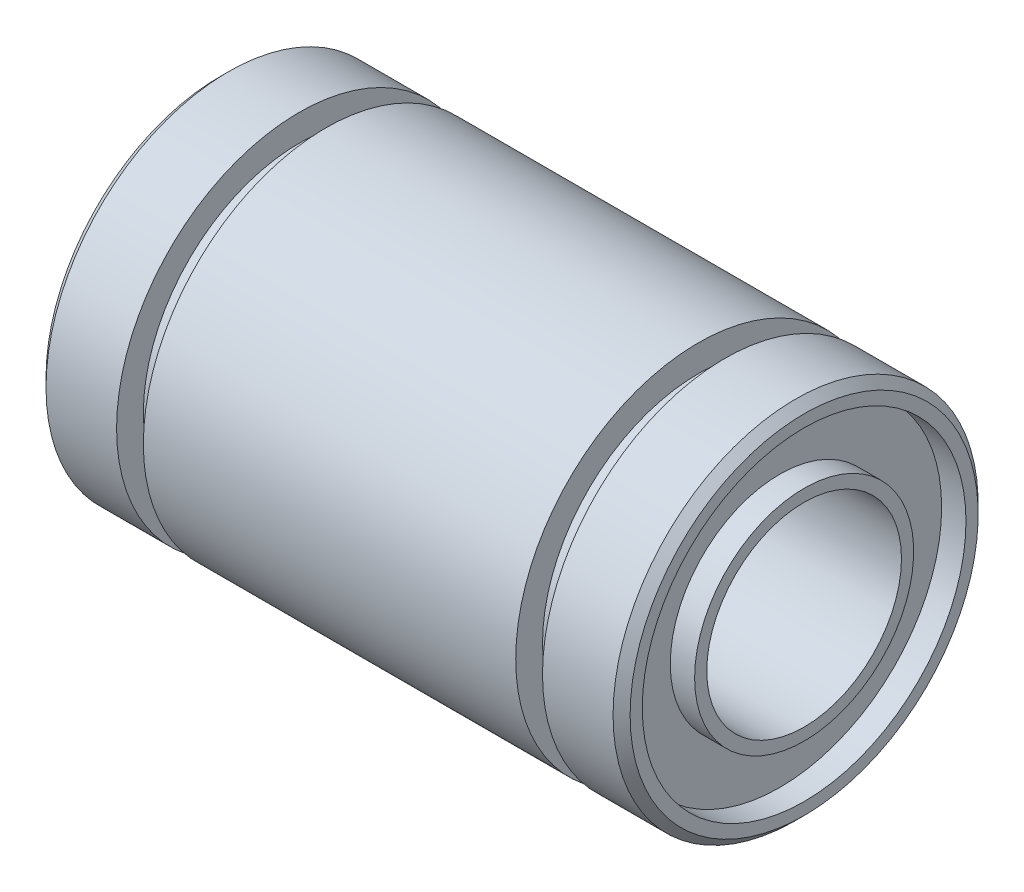
ISO-10303-21;
HEADER;
FILE_DESCRIPTION(('STEP AP214'),'2;1');
FILE_NAME('part.step','',(''),(''),'','','');
FILE_SCHEMA(('AUTOMOTIVE_DESIGN { 1 0 10303 214 1 1 1 1 }'));
ENDSEC;
DATA;
#1=APPLICATION_CONTEXT('core data for automotive mechanical design processes');
#2=APPLICATION_PROTOCOL_DEFINITION('international standard','automotive_design',2000,#1);
#3=PRODUCT_CONTEXT('',#1,'mechanical');
#4=PRODUCT('Part','Part','',(#3));
#5=PRODUCT_RELATED_PRODUCT_CATEGORY('part','',(#4));
#6=PRODUCT_DEFINITION_FORMATION('','',#4);
#7=PRODUCT_DEFINITION_CONTEXT('part definition',#1,'design');
#8=PRODUCT_DEFINITION('design','',#6,#7);
#9=PRODUCT_DEFINITION_SHAPE('','',#8);
#10=(LENGTH_UNIT() NAMED_UNIT(*) SI_UNIT(.MILLI.,.METRE.));
#11=(NAMED_UNIT(*) PLANE_ANGLE_UNIT() SI_UNIT($,.RADIAN.));
#12=(NAMED_UNIT(*) SI_UNIT($,.STERADIAN.) SOLID_ANGLE_UNIT());
#13=UNCERTAINTY_MEASURE_WITH_UNIT(LENGTH_MEASURE(1.E-05),#10,'distance_accuracy_value','');
#14=(GEOMETRIC_REPRESENTATION_CONTEXT(3) GLOBAL_UNCERTAINTY_ASSIGNED_CONTEXT((#13)) GLOBAL_UNIT_ASSIGNED_CONTEXT((#10,
#11,#12)) REPRESENTATION_CONTEXT('',''));
#15=CARTESIAN_POINT('',(0.,0.,0.));
#16=DIRECTION('',(0.,0.,1.));
#17=DIRECTION('',(1.,0.,0.));
#18=AXIS2_PLACEMENT_3D('',#15,#16,#17);
#19=CARTESIAN_POINT('',(11.65,0.,0.));
#20=DIRECTION('',(-1.,0.,0.));
#21=DIRECTION('',(0.,0.,1.));
#22=AXIS2_PLACEMENT_3D('',#19,#20,#21);
#23=CONICAL_SURFACE('',#22,7.5,0.78539816339745);
#24=CARTESIAN_POINT('',(12.,0.,0.));
#25=DIRECTION('',(-1.,0.,0.));
#26=DIRECTION('',(0.,0.,1.));
#27=AXIS2_PLACEMENT_3D('',#24,#25,#26);
#28=CIRCLE('',#27,7.15);
#29=CARTESIAN_POINT('',(12.,0.,7.15));
#30=VERTEX_POINT('',#29);
#31=EDGE_CURVE('E109',#30,#30,#28,.T.);
#32=ORIENTED_EDGE('',*,*,#31,.T.);
#33=EDGE_LOOP('',(#32));
#34=FACE_BOUND('',#33,.T.);
#35=CARTESIAN_POINT('',(11.65,0.,0.));
#36=DIRECTION('',(-1.,0.,0.));
#37=DIRECTION('',(0.,0.,1.));
#38=AXIS2_PLACEMENT_3D('',#35,#36,#37);
#39=CIRCLE('',#38,7.5);
#40=CARTESIAN_POINT('',(11.65,0.,7.5));
#41=VERTEX_POINT('',#40);
#42=EDGE_CURVE('E10',#41,#41,#39,.T.);
#43=ORIENTED_EDGE('',*,*,#42,.F.);
#44=EDGE_LOOP('',(#43));
#45=FACE_BOUND('',#44,.T.);
#46=ADVANCED_FACE('F39',(#34,#45),#23,.T.);
#47=CARTESIAN_POINT('',(-45.6895053247726,0.,0.));
#48=DIRECTION('',(-1.,0.,0.));
#49=DIRECTION('',(0.,0.,1.));
#50=AXIS2_PLACEMENT_3D('',#47,#48,#49);
#51=CYLINDRICAL_SURFACE('',#50,7.5);
#52=CARTESIAN_POINT('',(8.75000000000001,0.,0.));
#53=DIRECTION('',(-1.,0.,0.));
#54=DIRECTION('',(0.,0.,1.));
#55=AXIS2_PLACEMENT_3D('',#52,#53,#54);
#56=CIRCLE('',#55,7.5);
#57=CARTESIAN_POINT('',(8.75000000000001,0.,7.5));
#58=VERTEX_POINT('',#57);
#59=EDGE_CURVE('E45',#58,#58,#56,.T.);
#60=ORIENTED_EDGE('',*,*,#59,.F.);
#61=EDGE_LOOP('',(#60));
#62=FACE_BOUND('',#61,.T.);
#63=ORIENTED_EDGE('',*,*,#42,.T.);
#64=EDGE_LOOP('',(#63));
#65=FACE_BOUND('',#64,.T.);
#66=ADVANCED_FACE('F127',(#62,#65),#51,.T.);
#67=CARTESIAN_POINT('',(8.75000000000001,0.,0.));
#68=DIRECTION('',(1.,0.,0.));
#69=DIRECTION('',(0.,0.,-1.));
#70=AXIS2_PLACEMENT_3D('',#67,#68,#69);
#71=PLANE('',#70);
#72=CARTESIAN_POINT('',(8.75000000000001,0.,0.));
#73=DIRECTION('',(-1.,0.,0.));
#74=DIRECTION('',(0.,0.,1.));
#75=AXIS2_PLACEMENT_3D('',#72,#73,#74);
#76=CIRCLE('',#75,6.4);
#77=CARTESIAN_POINT('',(8.75000000000001,0.,6.4));
#78=VERTEX_POINT('',#77);
#79=EDGE_CURVE('E49',#78,#78,#76,.T.);
#80=ORIENTED_EDGE('',*,*,#79,.F.);
#81=EDGE_LOOP('',(#80));
#82=FACE_BOUND('',#81,.T.);
#83=ORIENTED_EDGE('',*,*,#59,.T.);
#84=EDGE_LOOP('',(#83));
#85=FACE_BOUND('',#84,.T.);
#86=ADVANCED_FACE('F131',(#82,#85),#71,.F.);
#87=CARTESIAN_POINT('',(-45.6895053247726,0.,0.));
#88=DIRECTION('',(-1.,0.,0.));
#89=DIRECTION('',(0.,0.,1.));
#90=AXIS2_PLACEMENT_3D('',#87,#88,#89);
#91=CYLINDRICAL_SURFACE('',#90,6.4);
#92=CARTESIAN_POINT('',(7.65,0.,0.));
#93=DIRECTION('',(-1.,0.,0.));
#94=DIRECTION('',(0.,0.,1.));
#95=AXIS2_PLACEMENT_3D('',#92,#93,#94);
#96=CIRCLE('',#95,6.4);
#97=CARTESIAN_POINT('',(7.65,0.,6.4));
#98=VERTEX_POINT('',#97);
#99=EDGE_CURVE('E53',#98,#98,#96,.T.);
#100=ORIENTED_EDGE('',*,*,#99,.F.);
#101=EDGE_LOOP('',(#100));
#102=FACE_BOUND('',#101,.T.);
#103=ORIENTED_EDGE('',*,*,#79,.T.);
#104=EDGE_LOOP('',(#103));
#105=FACE_BOUND('',#104,.T.);
#106=ADVANCED_FACE('F136',(#102,#105),#91,.T.);
#107=CARTESIAN_POINT('',(7.65,0.,0.));
#108=DIRECTION('',(-1.,0.,0.));
#109=DIRECTION('',(0.,0.,1.));
#110=AXIS2_PLACEMENT_3D('',#107,#108,#109);
#111=PLANE('',#110);
#112=CARTESIAN_POINT('',(7.65,0.,0.));
#113=DIRECTION('',(-1.,0.,0.));
#114=DIRECTION('',(0.,0.,1.));
#115=AXIS2_PLACEMENT_3D('',#112,#113,#114);
#116=CIRCLE('',#115,7.5);
#117=CARTESIAN_POINT('',(7.65,0.,7.5));
#118=VERTEX_POINT('',#117);
#119=EDGE_CURVE('E58',#118,#118,#116,.T.);
#120=ORIENTED_EDGE('',*,*,#119,.F.);
#121=EDGE_LOOP('',(#120));
#122=FACE_BOUND('',#121,.T.);
#123=ORIENTED_EDGE('',*,*,#99,.T.);
#124=EDGE_LOOP('',(#123));
#125=FACE_BOUND('',#124,.T.);
#126=ADVANCED_FACE('F142',(#122,#125),#111,.F.);
#127=CARTESIAN_POINT('',(-45.6895053247726,0.,0.));
#128=DIRECTION('',(-1.,0.,0.));
#129=DIRECTION('',(0.,0.,1.));
#130=AXIS2_PLACEMENT_3D('',#127,#128,#129);
#131=CYLINDRICAL_SURFACE('',#130,7.5);
#132=ORIENTED_EDGE('',*,*,#119,.T.);
#133=EDGE_LOOP('',(#132));
#134=FACE_BOUND('',#133,.T.);
#135=CARTESIAN_POINT('',(-7.65,0.,0.));
#136=DIRECTION('',(-1.,0.,0.));
#137=DIRECTION('',(0.,0.,1.));
#138=AXIS2_PLACEMENT_3D('',#135,#136,#137);
#139=CIRCLE('',#138,7.5);
#140=CARTESIAN_POINT('',(-7.65,0.,7.5));
#141=VERTEX_POINT('',#140);
#142=EDGE_CURVE('E61',#141,#141,#139,.T.);
#143=ORIENTED_EDGE('',*,*,#142,.F.);
#144=EDGE_LOOP('',(#143));
#145=FACE_BOUND('',#144,.T.);
#146=ADVANCED_FACE('F146',(#134,#145),#131,.T.);
#147=CARTESIAN_POINT('',(-7.65,0.,0.));
#148=DIRECTION('',(-1.,0.,0.));
#149=DIRECTION('',(0.,0.,1.));
#150=AXIS2_PLACEMENT_3D('',#147,#148,#149);
#151=PLANE('',#150);
#152=ORIENTED_EDGE('',*,*,#142,.T.);
#153=EDGE_LOOP('',(#152));
#154=FACE_BOUND('',#153,.T.);
#155=CARTESIAN_POINT('',(-7.65,0.,0.));
#156=DIRECTION('',(-1.,0.,0.));
#157=DIRECTION('',(0.,0.,1.));
#158=AXIS2_PLACEMENT_3D('',#155,#156,#157);
#159=CIRCLE('',#158,6.4);
#160=CARTESIAN_POINT('',(-7.65,0.,6.4));
#161=VERTEX_POINT('',#160);
#162=EDGE_CURVE('E64',#161,#161,#159,.T.);
#163=ORIENTED_EDGE('',*,*,#162,.F.);
#164=EDGE_LOOP('',(#163));
#165=FACE_BOUND('',#164,.T.);
#166=ADVANCED_FACE('F150',(#154,#165),#151,.T.);
#167=CARTESIAN_POINT('',(-45.6895053247726,0.,0.));
#168=DIRECTION('',(-1.,0.,0.));
#169=DIRECTION('',(0.,0.,1.));
#170=AXIS2_PLACEMENT_3D('',#167,#168,#169);
#171=CYLINDRICAL_SURFACE('',#170,6.4);
#172=ORIENTED_EDGE('',*,*,#162,.T.);
#173=EDGE_LOOP('',(#172));
#174=FACE_BOUND('',#173,.T.);
#175=CARTESIAN_POINT('',(-8.74999999999999,0.,0.));
#176=DIRECTION('',(-1.,0.,0.));
#177=DIRECTION('',(0.,0.,1.));
#178=AXIS2_PLACEMENT_3D('',#175,#176,#177);
#179=CIRCLE('',#178,6.4);
#180=CARTESIAN_POINT('',(-8.74999999999999,0.,6.4));
#181=VERTEX_POINT('',#180);
#182=EDGE_CURVE('E67',#181,#181,#179,.T.);
#183=ORIENTED_EDGE('',*,*,#182,.F.);
#184=EDGE_LOOP('',(#183));
#185=FACE_BOUND('',#184,.T.);
#186=ADVANCED_FACE('F154',(#174,#185),#171,.T.);
#187=CARTESIAN_POINT('',(-8.75,0.,0.));
#188=DIRECTION('',(1.,0.,0.));
#189=DIRECTION('',(0.,0.,-1.));
#190=AXIS2_PLACEMENT_3D('',#187,#188,#189);
#191=PLANE('',#190);
#192=ORIENTED_EDGE('',*,*,#182,.T.);
#193=EDGE_LOOP('',(#192));
#194=FACE_BOUND('',#193,.T.);
#195=CARTESIAN_POINT('',(-8.74999999999999,0.,0.));
#196=DIRECTION('',(-1.,0.,0.));
#197=DIRECTION('',(0.,0.,1.));
#198=AXIS2_PLACEMENT_3D('',#195,#196,#197);
#199=CIRCLE('',#198,7.5);
#200=CARTESIAN_POINT('',(-8.74999999999999,0.,7.5));
#201=VERTEX_POINT('',#200);
#202=EDGE_CURVE('E70',#201,#201,#199,.T.);
#203=ORIENTED_EDGE('',*,*,#202,.F.);
#204=EDGE_LOOP('',(#203));
#205=FACE_BOUND('',#204,.T.);
#206=ADVANCED_FACE('F158',(#194,#205),#191,.T.);
#207=CARTESIAN_POINT('',(-45.6895053247726,0.,0.));
#208=DIRECTION('',(-1.,0.,0.));
#209=DIRECTION('',(0.,0.,1.));
#210=AXIS2_PLACEMENT_3D('',#207,#208,#209);
#211=CYLINDRICAL_SURFACE('',#210,7.5);
#212=ORIENTED_EDGE('',*,*,#202,.T.);
#213=EDGE_LOOP('',(#212));
#214=FACE_BOUND('',#213,.T.);
#215=CARTESIAN_POINT('',(-11.65,0.,0.));
#216=DIRECTION('',(-1.,0.,0.));
#217=DIRECTION('',(0.,0.,1.));
#218=AXIS2_PLACEMENT_3D('',#215,#216,#217);
#219=CIRCLE('',#218,7.5);
#220=CARTESIAN_POINT('',(-11.65,0.,7.5));
#221=VERTEX_POINT('',#220);
#222=EDGE_CURVE('E73',#221,#221,#219,.T.);
#223=ORIENTED_EDGE('',*,*,#222,.F.);
#224=EDGE_LOOP('',(#223));
#225=FACE_BOUND('',#224,.T.);
#226=ADVANCED_FACE('F162',(#214,#225),#211,.T.);
#227=CARTESIAN_POINT('',(-11.65,0.,0.));
#228=DIRECTION('',(1.,0.,0.));
#229=DIRECTION('',(0.,0.,-1.));
#230=AXIS2_PLACEMENT_3D('',#227,#228,#229);
#231=CONICAL_SURFACE('',#230,7.5,0.78539816339745);
#232=CARTESIAN_POINT('',(-12.,0.,0.));
#233=DIRECTION('',(-1.,0.,0.));
#234=DIRECTION('',(0.,0.,1.));
#235=AXIS2_PLACEMENT_3D('',#232,#233,#234);
#236=CIRCLE('',#235,7.15);
#237=CARTESIAN_POINT('',(-12.,0.,7.15));
#238=VERTEX_POINT('',#237);
#239=EDGE_CURVE('E76',#238,#238,#236,.T.);
#240=ORIENTED_EDGE('',*,*,#239,.F.);
#241=EDGE_LOOP('',(#240));
#242=FACE_BOUND('',#241,.T.);
#243=ORIENTED_EDGE('',*,*,#222,.T.);
#244=EDGE_LOOP('',(#243));
#245=FACE_BOUND('',#244,.T.);
#246=ADVANCED_FACE('F166',(#242,#245),#231,.T.);
#247=CARTESIAN_POINT('',(-12.,0.,0.));
#248=DIRECTION('',(1.,0.,0.));
#249=DIRECTION('',(0.,0.,-1.));
#250=AXIS2_PLACEMENT_3D('',#247,#248,#249);
#251=PLANE('',#250);
#252=CARTESIAN_POINT('',(-12.,0.,0.));
#253=DIRECTION('',(-1.,0.,0.));
#254=DIRECTION('',(0.,0.,1.));
#255=AXIS2_PLACEMENT_3D('',#252,#253,#254);
#256=CIRCLE('',#255,6.65);
#257=CARTESIAN_POINT('',(-12.,0.,6.65));
#258=VERTEX_POINT('',#257);
#259=EDGE_CURVE('E79',#258,#258,#256,.T.);
#260=ORIENTED_EDGE('',*,*,#259,.F.);
#261=EDGE_LOOP('',(#260));
#262=FACE_BOUND('',#261,.T.);
#263=ORIENTED_EDGE('',*,*,#239,.T.);
#264=EDGE_LOOP('',(#263));
#265=FACE_BOUND('',#264,.T.);
#266=ADVANCED_FACE('F170',(#262,#265),#251,.F.);
#267=CARTESIAN_POINT('',(-45.6895053247726,0.,0.));
#268=DIRECTION('',(-1.,0.,0.));
#269=DIRECTION('',(0.,0.,1.));
#270=AXIS2_PLACEMENT_3D('',#267,#268,#269);
#271=CYLINDRICAL_SURFACE('',#270,6.65);
#272=CARTESIAN_POINT('',(-11.,0.,0.));
#273=DIRECTION('',(-1.,0.,0.));
#274=DIRECTION('',(0.,0.,1.));
#275=AXIS2_PLACEMENT_3D('',#272,#273,#274);
#276=CIRCLE('',#275,6.65);
#277=CARTESIAN_POINT('',(-11.,0.,6.65));
#278=VERTEX_POINT('',#277);
#279=EDGE_CURVE('E82',#278,#278,#276,.T.);
#280=ORIENTED_EDGE('',*,*,#279,.F.);
#281=EDGE_LOOP('',(#280));
#282=FACE_BOUND('',#281,.T.);
#283=ORIENTED_EDGE('',*,*,#259,.T.);
#284=EDGE_LOOP('',(#283));
#285=FACE_BOUND('',#284,.T.);
#286=ADVANCED_FACE('F174',(#282,#285),#271,.F.);
#287=CARTESIAN_POINT('',(-11.,0.,0.));
#288=DIRECTION('',(1.,0.,0.));
#289=DIRECTION('',(0.,0.,-1.));
#290=AXIS2_PLACEMENT_3D('',#287,#288,#289);
#291=PLANE('',#290);
#292=CARTESIAN_POINT('',(-11.,0.,0.));
#293=DIRECTION('',(-1.,0.,0.));
#294=DIRECTION('',(0.,0.,1.));
#295=AXIS2_PLACEMENT_3D('',#292,#293,#294);
#296=CIRCLE('',#295,4.5);
#297=CARTESIAN_POINT('',(-11.,0.,4.5));
#298=VERTEX_POINT('',#297);
#299=EDGE_CURVE('E85',#298,#298,#296,.T.);
#300=ORIENTED_EDGE('',*,*,#299,.F.);
#301=EDGE_LOOP('',(#300));
#302=FACE_BOUND('',#301,.T.);
#303=ORIENTED_EDGE('',*,*,#279,.T.);
#304=EDGE_LOOP('',(#303));
#305=FACE_BOUND('',#304,.T.);
#306=ADVANCED_FACE('F178',(#302,#305),#291,.F.);
#307=CARTESIAN_POINT('',(-45.6895053247726,0.,0.));
#308=DIRECTION('',(-1.,0.,0.));
#309=DIRECTION('',(0.,0.,1.));
#310=AXIS2_PLACEMENT_3D('',#307,#308,#309);
#311=CYLINDRICAL_SURFACE('',#310,4.5);
#312=CARTESIAN_POINT('',(-12.,0.,0.));
#313=DIRECTION('',(-1.,0.,0.));
#314=DIRECTION('',(0.,0.,1.));
#315=AXIS2_PLACEMENT_3D('',#312,#313,#314);
#316=CIRCLE('',#315,4.5);
#317=CARTESIAN_POINT('',(-12.,0.,4.5));
#318=VERTEX_POINT('',#317);
#319=EDGE_CURVE('E88',#318,#318,#316,.T.);
#320=ORIENTED_EDGE('',*,*,#319,.F.);
#321=EDGE_LOOP('',(#320));
#322=FACE_BOUND('',#321,.T.);
#323=ORIENTED_EDGE('',*,*,#299,.T.);
#324=EDGE_LOOP('',(#323));
#325=FACE_BOUND('',#324,.T.);
#326=ADVANCED_FACE('F182',(#322,#325),#311,.T.);
#327=CARTESIAN_POINT('',(-12.,0.,0.));
#328=DIRECTION('',(1.,0.,0.));
#329=DIRECTION('',(0.,0.,-1.));
#330=AXIS2_PLACEMENT_3D('',#327,#328,#329);
#331=PLANE('',#330);
#332=CARTESIAN_POINT('',(-12.,0.,0.));
#333=DIRECTION('',(-1.,0.,0.));
#334=DIRECTION('',(0.,0.,1.));
#335=AXIS2_PLACEMENT_3D('',#332,#333,#334);
#336=CIRCLE('',#335,4.);
#337=CARTESIAN_POINT('',(-12.,0.,4.));
#338=VERTEX_POINT('',#337);
#339=EDGE_CURVE('E91',#338,#338,#336,.T.);
#340=ORIENTED_EDGE('',*,*,#339,.F.);
#341=EDGE_LOOP('',(#340));
#342=FACE_BOUND('',#341,.T.);
#343=ORIENTED_EDGE('',*,*,#319,.T.);
#344=EDGE_LOOP('',(#343));
#345=FACE_BOUND('',#344,.T.);
#346=ADVANCED_FACE('F186',(#342,#345),#331,.F.);
#347=CARTESIAN_POINT('',(-45.6895053247726,0.,0.));
#348=DIRECTION('',(-1.,0.,0.));
#349=DIRECTION('',(0.,0.,1.));
#350=AXIS2_PLACEMENT_3D('',#347,#348,#349);
#351=CYLINDRICAL_SURFACE('',#350,4.);
#352=CARTESIAN_POINT('',(12.,0.,0.));
#353=DIRECTION('',(-1.,0.,0.));
#354=DIRECTION('',(0.,0.,1.));
#355=AXIS2_PLACEMENT_3D('',#352,#353,#354);
#356=CIRCLE('',#355,4.);
#357=CARTESIAN_POINT('',(12.,0.,4.));
#358=VERTEX_POINT('',#357);
#359=EDGE_CURVE('E94',#358,#358,#356,.T.);
#360=ORIENTED_EDGE('',*,*,#359,.F.);
#361=EDGE_LOOP('',(#360));
#362=FACE_BOUND('',#361,.T.);
#363=ORIENTED_EDGE('',*,*,#339,.T.);
#364=EDGE_LOOP('',(#363));
#365=FACE_BOUND('',#364,.T.);
#366=ADVANCED_FACE('F190',(#362,#365),#351,.F.);
#367=CARTESIAN_POINT('',(12.,0.,0.));
#368=DIRECTION('',(1.,0.,0.));
#369=DIRECTION('',(0.,0.,-1.));
#370=AXIS2_PLACEMENT_3D('',#367,#368,#369);
#371=PLANE('',#370);
#372=ORIENTED_EDGE('',*,*,#359,.T.);
#373=EDGE_LOOP('',(#372));
#374=FACE_BOUND('',#373,.T.);
#375=CARTESIAN_POINT('',(12.,0.,0.));
#376=DIRECTION('',(-1.,0.,0.));
#377=DIRECTION('',(0.,0.,1.));
#378=AXIS2_PLACEMENT_3D('',#375,#376,#377);
#379=CIRCLE('',#378,4.5);
#380=CARTESIAN_POINT('',(12.,0.,4.5));
#381=VERTEX_POINT('',#380);
#382=EDGE_CURVE('E97',#381,#381,#379,.T.);
#383=ORIENTED_EDGE('',*,*,#382,.F.);
#384=EDGE_LOOP('',(#383));
#385=FACE_BOUND('',#384,.T.);
#386=ADVANCED_FACE('F194',(#374,#385),#371,.T.);
#387=CARTESIAN_POINT('',(-45.6895053247726,0.,0.));
#388=DIRECTION('',(-1.,0.,0.));
#389=DIRECTION('',(0.,0.,1.));
#390=AXIS2_PLACEMENT_3D('',#387,#388,#389);
#391=CYLINDRICAL_SURFACE('',#390,4.5);
#392=ORIENTED_EDGE('',*,*,#382,.T.);
#393=EDGE_LOOP('',(#392));
#394=FACE_BOUND('',#393,.T.);
#395=CARTESIAN_POINT('',(11.,0.,0.));
#396=DIRECTION('',(-1.,0.,0.));
#397=DIRECTION('',(0.,0.,1.));
#398=AXIS2_PLACEMENT_3D('',#395,#396,#397);
#399=CIRCLE('',#398,4.5);
#400=CARTESIAN_POINT('',(11.,0.,4.5));
#401=VERTEX_POINT('',#400);
#402=EDGE_CURVE('E100',#401,#401,#399,.T.);
#403=ORIENTED_EDGE('',*,*,#402,.F.);
#404=EDGE_LOOP('',(#403));
#405=FACE_BOUND('',#404,.T.);
#406=ADVANCED_FACE('F198',(#394,#405),#391,.T.);
#407=CARTESIAN_POINT('',(11.,0.,0.));
#408=DIRECTION('',(1.,0.,0.));
#409=DIRECTION('',(0.,0.,-1.));
#410=AXIS2_PLACEMENT_3D('',#407,#408,#409);
#411=PLANE('',#410);
#412=ORIENTED_EDGE('',*,*,#402,.T.);
#413=EDGE_LOOP('',(#412));
#414=FACE_BOUND('',#413,.T.);
#415=CARTESIAN_POINT('',(11.,0.,0.));
#416=DIRECTION('',(-1.,0.,0.));
#417=DIRECTION('',(0.,0.,1.));
#418=AXIS2_PLACEMENT_3D('',#415,#416,#417);
#419=CIRCLE('',#418,6.65);
#420=CARTESIAN_POINT('',(11.,0.,6.65));
#421=VERTEX_POINT('',#420);
#422=EDGE_CURVE('E103',#421,#421,#419,.T.);
#423=ORIENTED_EDGE('',*,*,#422,.F.);
#424=EDGE_LOOP('',(#423));
#425=FACE_BOUND('',#424,.T.);
#426=ADVANCED_FACE('F123',(#414,#425),#411,.T.);
#427=CARTESIAN_POINT('',(-45.6895053247726,0.,0.));
#428=DIRECTION('',(-1.,0.,0.));
#429=DIRECTION('',(0.,0.,1.));
#430=AXIS2_PLACEMENT_3D('',#427,#428,#429);
#431=CYLINDRICAL_SURFACE('',#430,6.65);
#432=ORIENTED_EDGE('',*,*,#422,.T.);
#433=EDGE_LOOP('',(#432));
#434=FACE_BOUND('',#433,.T.);
#435=CARTESIAN_POINT('',(12.,0.,0.));
#436=DIRECTION('',(-1.,0.,0.));
#437=DIRECTION('',(0.,0.,1.));
#438=AXIS2_PLACEMENT_3D('',#435,#436,#437);
#439=CIRCLE('',#438,6.65);
#440=CARTESIAN_POINT('',(12.,0.,6.65));
#441=VERTEX_POINT('',#440);
#442=EDGE_CURVE('E106',#441,#441,#439,.T.);
#443=ORIENTED_EDGE('',*,*,#442,.F.);
#444=EDGE_LOOP('',(#443));
#445=FACE_BOUND('',#444,.T.);
#446=ADVANCED_FACE('F117',(#434,#445),#431,.F.);
#447=CARTESIAN_POINT('',(12.,0.,0.));
#448=DIRECTION('',(1.,0.,0.));
#449=DIRECTION('',(0.,0.,-1.));
#450=AXIS2_PLACEMENT_3D('',#447,#448,#449);
#451=PLANE('',#450);
#452=ORIENTED_EDGE('',*,*,#442,.T.);
#453=EDGE_LOOP('',(#452));
#454=FACE_BOUND('',#453,.T.);
#455=ORIENTED_EDGE('',*,*,#31,.F.);
#456=EDGE_LOOP('',(#455));
#457=FACE_BOUND('',#456,.T.);
#458=ADVANCED_FACE('F115',(#454,#457),#451,.T.);
#459=CLOSED_SHELL('',(#46,#66,#86,#106,#126,#146,#166,#186,#206,#226,#246,#266,#286,#306,#326,
#346,#366,#386,#406,#426,#446,#458));
#460=MANIFOLD_SOLID_BREP('B2',#459);
#461=ADVANCED_BREP_SHAPE_REPRESENTATION('',(#18,#460),#14);
#462=SHAPE_DEFINITION_REPRESENTATION(#9,#461);
ENDSEC;
END-ISO-10303-21;
